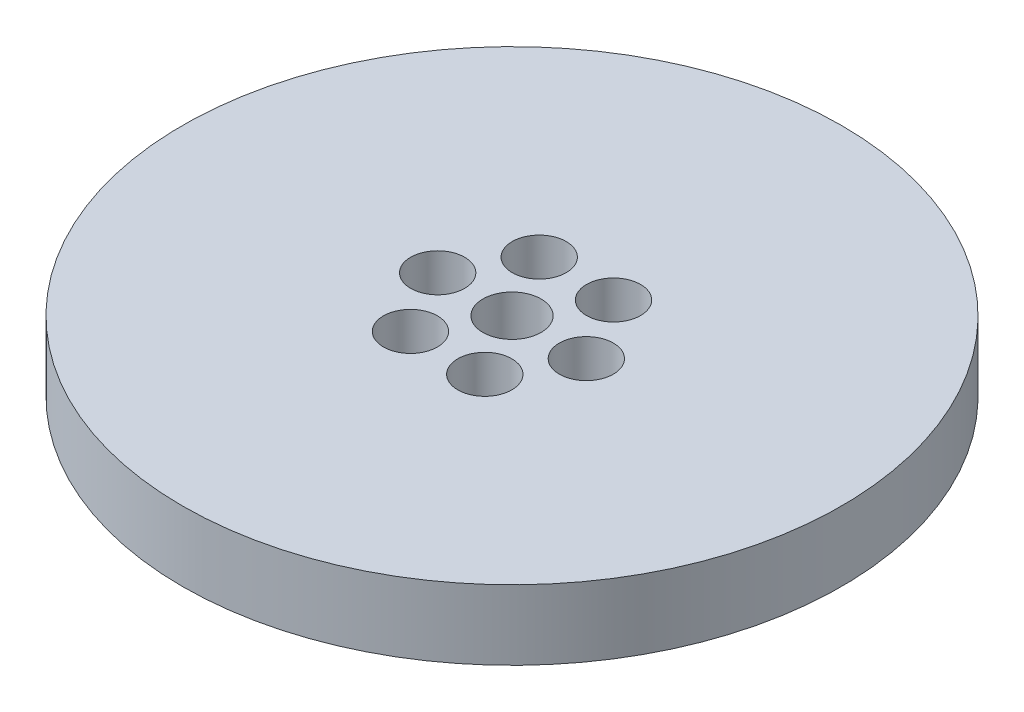
ISO-10303-21;
HEADER;
FILE_DESCRIPTION(('STEP AP214'),'2;1');
FILE_NAME('part.step','',(''),(''),'','','');
FILE_SCHEMA(('AUTOMOTIVE_DESIGN { 1 0 10303 214 1 1 1 1 }'));
ENDSEC;
DATA;
#1=APPLICATION_CONTEXT('core data for automotive mechanical design processes');
#2=APPLICATION_PROTOCOL_DEFINITION('international standard','automotive_design',2000,#1);
#3=PRODUCT_CONTEXT('',#1,'mechanical');
#4=PRODUCT('Part','Part','',(#3));
#5=PRODUCT_RELATED_PRODUCT_CATEGORY('part','',(#4));
#6=PRODUCT_DEFINITION_FORMATION('','',#4);
#7=PRODUCT_DEFINITION_CONTEXT('part definition',#1,'design');
#8=PRODUCT_DEFINITION('design','',#6,#7);
#9=PRODUCT_DEFINITION_SHAPE('','',#8);
#10=(LENGTH_UNIT() NAMED_UNIT(*) SI_UNIT(.MILLI.,.METRE.));
#11=(NAMED_UNIT(*) PLANE_ANGLE_UNIT() SI_UNIT($,.RADIAN.));
#12=(NAMED_UNIT(*) SI_UNIT($,.STERADIAN.) SOLID_ANGLE_UNIT());
#13=UNCERTAINTY_MEASURE_WITH_UNIT(LENGTH_MEASURE(1.E-05),#10,'distance_accuracy_value','');
#14=(GEOMETRIC_REPRESENTATION_CONTEXT(3) GLOBAL_UNCERTAINTY_ASSIGNED_CONTEXT((#13)) GLOBAL_UNIT_ASSIGNED_CONTEXT((#10,
#11,#12)) REPRESENTATION_CONTEXT('',''));
#15=CARTESIAN_POINT('',(0.,0.,0.));
#16=DIRECTION('',(0.,0.,1.));
#17=DIRECTION('',(1.,0.,0.));
#18=AXIS2_PLACEMENT_3D('',#15,#16,#17);
#19=CARTESIAN_POINT('',(0.,18.,0.));
#20=DIRECTION('',(0.,-1.,0.));
#21=DIRECTION('',(0.,0.,-1.));
#22=AXIS2_PLACEMENT_3D('',#19,#20,#21);
#23=CYLINDRICAL_SURFACE('',#22,85.);
#24=CARTESIAN_POINT('',(0.,18.,0.));
#25=DIRECTION('',(0.,1.,0.));
#26=DIRECTION('',(0.,0.,1.));
#27=AXIS2_PLACEMENT_3D('',#24,#25,#26);
#28=CIRCLE('',#27,85.);
#29=CARTESIAN_POINT('',(0.,18.,85.));
#30=VERTEX_POINT('',#29);
#31=EDGE_CURVE('E10',#30,#30,#28,.T.);
#32=ORIENTED_EDGE('',*,*,#31,.F.);
#33=EDGE_LOOP('',(#32));
#34=FACE_BOUND('',#33,.T.);
#35=CARTESIAN_POINT('',(0.,0.,0.));
#36=DIRECTION('',(0.,1.,0.));
#37=DIRECTION('',(0.,0.,1.));
#38=AXIS2_PLACEMENT_3D('',#35,#36,#37);
#39=CIRCLE('',#38,85.);
#40=CARTESIAN_POINT('',(0.,0.,85.));
#41=VERTEX_POINT('',#40);
#42=EDGE_CURVE('E37',#41,#41,#39,.T.);
#43=ORIENTED_EDGE('',*,*,#42,.T.);
#44=EDGE_LOOP('',(#43));
#45=FACE_BOUND('',#44,.T.);
#46=ADVANCED_FACE('F40',(#34,#45),#23,.T.);
#47=CARTESIAN_POINT('',(0.,18.,0.));
#48=DIRECTION('',(0.,1.,0.));
#49=DIRECTION('',(0.,0.,1.));
#50=AXIS2_PLACEMENT_3D('',#47,#48,#49);
#51=PLANE('',#50);
#52=CARTESIAN_POINT('',(-9.58529014640994,18.,-16.6022095388709));
#53=DIRECTION('',(0.,1.,0.));
#54=DIRECTION('',(-0.866025403784433,0.,0.50000000000001));
#55=AXIS2_PLACEMENT_3D('',#52,#53,#54);
#56=CIRCLE('',#55,6.96595925630618);
#57=CARTESIAN_POINT('',(-15.6179878240984,18.,-13.1192299107177));
#58=VERTEX_POINT('',#57);
#59=EDGE_CURVE('E70',#58,#58,#56,.T.);
#60=ORIENTED_EDGE('',*,*,#59,.F.);
#61=EDGE_LOOP('',(#60));
#62=FACE_BOUND('',#61,.T.);
#63=CARTESIAN_POINT('',(9.58529014640959,18.,-16.6022095388711));
#64=DIRECTION('',(0.,1.,0.));
#65=DIRECTION('',(-0.866025403784443,0.,-0.499999999999992));
#66=AXIS2_PLACEMENT_3D('',#63,#64,#65);
#67=CIRCLE('',#66,6.96595925630618);
#68=CARTESIAN_POINT('',(3.55259246872105,18.,-20.0851891670241));
#69=VERTEX_POINT('',#68);
#70=EDGE_CURVE('E71',#69,#69,#67,.T.);
#71=ORIENTED_EDGE('',*,*,#70,.F.);
#72=EDGE_LOOP('',(#71));
#73=FACE_BOUND('',#72,.T.);
#74=CARTESIAN_POINT('',(19.1705802928195,18.,0.));
#75=DIRECTION('',(0.,1.,0.));
#76=DIRECTION('',(0.,0.,-1.));
#77=AXIS2_PLACEMENT_3D('',#74,#75,#76);
#78=CIRCLE('',#77,6.96595925630618);
#79=CARTESIAN_POINT('',(19.1705802928195,18.,-6.96595925630618));
#80=VERTEX_POINT('',#79);
#81=EDGE_CURVE('E78',#80,#80,#78,.T.);
#82=ORIENTED_EDGE('',*,*,#81,.F.);
#83=EDGE_LOOP('',(#82));
#84=FACE_BOUND('',#83,.T.);
#85=CARTESIAN_POINT('',(9.58529014640982,18.,16.602209538871));
#86=DIRECTION('',(0.,1.,0.));
#87=DIRECTION('',(0.866025403784436,0.,-0.500000000000004));
#88=AXIS2_PLACEMENT_3D('',#85,#86,#87);
#89=CIRCLE('',#88,6.96595925630618);
#90=CARTESIAN_POINT('',(15.6179878240983,18.,13.1192299107178));
#91=VERTEX_POINT('',#90);
#92=EDGE_CURVE('E84',#91,#91,#89,.T.);
#93=ORIENTED_EDGE('',*,*,#92,.F.);
#94=EDGE_LOOP('',(#93));
#95=FACE_BOUND('',#94,.T.);
#96=CARTESIAN_POINT('',(-9.5852901464097,18.,16.602209538871));
#97=DIRECTION('',(0.,1.,0.));
#98=DIRECTION('',(0.86602540378444,0.,0.499999999999998));
#99=AXIS2_PLACEMENT_3D('',#96,#97,#98);
#100=CIRCLE('',#99,6.96595925630618);
#101=CARTESIAN_POINT('',(-3.55259246872119,18.,20.0851891670241));
#102=VERTEX_POINT('',#101);
#103=EDGE_CURVE('E61',#102,#102,#100,.T.);
#104=ORIENTED_EDGE('',*,*,#103,.F.);
#105=EDGE_LOOP('',(#104));
#106=FACE_BOUND('',#105,.T.);
#107=CARTESIAN_POINT('',(-19.1705802928195,18.,0.));
#108=DIRECTION('',(0.,1.,0.));
#109=DIRECTION('',(0.,0.,1.));
#110=AXIS2_PLACEMENT_3D('',#107,#108,#109);
#111=CIRCLE('',#110,6.96595925630618);
#112=CARTESIAN_POINT('',(-19.1705802928195,18.,6.96595925630618));
#113=VERTEX_POINT('',#112);
#114=EDGE_CURVE('E54',#113,#113,#111,.T.);
#115=ORIENTED_EDGE('',*,*,#114,.F.);
#116=EDGE_LOOP('',(#115));
#117=FACE_BOUND('',#116,.T.);
#118=CARTESIAN_POINT('',(0.,18.,0.));
#119=DIRECTION('',(0.,1.,0.));
#120=DIRECTION('',(0.,0.,1.));
#121=AXIS2_PLACEMENT_3D('',#118,#119,#120);
#122=CIRCLE('',#121,7.5);
#123=CARTESIAN_POINT('',(0.,18.,7.5));
#124=VERTEX_POINT('',#123);
#125=EDGE_CURVE('E50',#124,#124,#122,.T.);
#126=ORIENTED_EDGE('',*,*,#125,.F.);
#127=EDGE_LOOP('',(#126));
#128=FACE_BOUND('',#127,.T.);
#129=ORIENTED_EDGE('',*,*,#31,.T.);
#130=EDGE_LOOP('',(#129));
#131=FACE_BOUND('',#130,.T.);
#132=ADVANCED_FACE('F99',(#62,#73,#84,#95,#106,#117,#128,#131),#51,.T.);
#133=CARTESIAN_POINT('',(0.,0.,0.));
#134=DIRECTION('',(0.,1.,0.));
#135=DIRECTION('',(0.,0.,1.));
#136=AXIS2_PLACEMENT_3D('',#133,#134,#135);
#137=PLANE('',#136);
#138=CARTESIAN_POINT('',(0.,0.,0.));
#139=DIRECTION('',(0.,1.,0.));
#140=DIRECTION('',(0.,0.,1.));
#141=AXIS2_PLACEMENT_3D('',#138,#139,#140);
#142=CIRCLE('',#141,7.5);
#143=CARTESIAN_POINT('',(0.,0.,7.5));
#144=VERTEX_POINT('',#143);
#145=EDGE_CURVE('E47',#144,#144,#142,.T.);
#146=ORIENTED_EDGE('',*,*,#145,.T.);
#147=EDGE_LOOP('',(#146));
#148=FACE_BOUND('',#147,.T.);
#149=ORIENTED_EDGE('',*,*,#42,.F.);
#150=EDGE_LOOP('',(#149));
#151=FACE_BOUND('',#150,.T.);
#152=ADVANCED_FACE('F103',(#148,#151),#137,.F.);
#153=CARTESIAN_POINT('',(0.,18.,0.));
#154=DIRECTION('',(0.,-1.,0.));
#155=DIRECTION('',(0.,0.,-1.));
#156=AXIS2_PLACEMENT_3D('',#153,#154,#155);
#157=CYLINDRICAL_SURFACE('',#156,7.5);
#158=ORIENTED_EDGE('',*,*,#125,.T.);
#159=EDGE_LOOP('',(#158));
#160=FACE_BOUND('',#159,.T.);
#161=ORIENTED_EDGE('',*,*,#145,.F.);
#162=EDGE_LOOP('',(#161));
#163=FACE_BOUND('',#162,.T.);
#164=ADVANCED_FACE('F115',(#160,#163),#157,.F.);
#165=CARTESIAN_POINT('',(-19.1705802928195,6.90566249601949,0.));
#166=DIRECTION('',(0.,1.,0.));
#167=DIRECTION('',(0.,0.,1.));
#168=AXIS2_PLACEMENT_3D('',#165,#166,#167);
#169=CYLINDRICAL_SURFACE('',#168,6.96595925630618);
#170=CARTESIAN_POINT('',(-19.1705802928195,6.90566249601949,0.));
#171=DIRECTION('',(0.,1.,0.));
#172=DIRECTION('',(0.,0.,1.));
#173=AXIS2_PLACEMENT_3D('',#170,#171,#172);
#174=CIRCLE('',#173,6.96595925630618);
#175=CARTESIAN_POINT('',(-19.1705802928195,6.90566249601949,6.96595925630618));
#176=VERTEX_POINT('',#175);
#177=EDGE_CURVE('E55',#176,#176,#174,.T.);
#178=ORIENTED_EDGE('',*,*,#177,.F.);
#179=EDGE_LOOP('',(#178));
#180=FACE_BOUND('',#179,.T.);
#181=ORIENTED_EDGE('',*,*,#114,.T.);
#182=EDGE_LOOP('',(#181));
#183=FACE_BOUND('',#182,.T.);
#184=ADVANCED_FACE('F113',(#180,#183),#169,.F.);
#185=CARTESIAN_POINT('',(-19.1705802928195,6.90566249601949,0.));
#186=DIRECTION('',(0.,1.,0.));
#187=DIRECTION('',(0.,0.,1.));
#188=AXIS2_PLACEMENT_3D('',#185,#186,#187);
#189=PLANE('',#188);
#190=ORIENTED_EDGE('',*,*,#177,.T.);
#191=EDGE_LOOP('',(#190));
#192=FACE_BOUND('',#191,.T.);
#193=ADVANCED_FACE('F144',(#192),#189,.T.);
#194=CARTESIAN_POINT('',(-9.5852901464097,6.90566249601949,16.602209538871));
#195=DIRECTION('',(0.,1.,0.));
#196=DIRECTION('',(0.,0.,1.));
#197=AXIS2_PLACEMENT_3D('',#194,#195,#196);
#198=CYLINDRICAL_SURFACE('',#197,6.96595925630618);
#199=CARTESIAN_POINT('',(-9.5852901464097,6.90566249601949,16.602209538871));
#200=DIRECTION('',(0.,1.,0.));
#201=DIRECTION('',(0.86602540378444,0.,0.499999999999998));
#202=AXIS2_PLACEMENT_3D('',#199,#200,#201);
#203=CIRCLE('',#202,6.96595925630618);
#204=CARTESIAN_POINT('',(-3.55259246872119,6.90566249601949,20.0851891670241));
#205=VERTEX_POINT('',#204);
#206=EDGE_CURVE('E59',#205,#205,#203,.T.);
#207=ORIENTED_EDGE('',*,*,#206,.F.);
#208=EDGE_LOOP('',(#207));
#209=FACE_BOUND('',#208,.T.);
#210=ORIENTED_EDGE('',*,*,#103,.T.);
#211=EDGE_LOOP('',(#210));
#212=FACE_BOUND('',#211,.T.);
#213=ADVANCED_FACE('F153',(#209,#212),#198,.F.);
#214=CARTESIAN_POINT('',(-9.5852901464097,6.90566249601949,16.602209538871));
#215=DIRECTION('',(0.,1.,0.));
#216=DIRECTION('',(0.86602540378444,0.,0.499999999999998));
#217=AXIS2_PLACEMENT_3D('',#214,#215,#216);
#218=PLANE('',#217);
#219=ORIENTED_EDGE('',*,*,#206,.T.);
#220=EDGE_LOOP('',(#219));
#221=FACE_BOUND('',#220,.T.);
#222=ADVANCED_FACE('F96',(#221),#218,.T.);
#223=CARTESIAN_POINT('',(9.58529014640982,6.90566249601949,16.602209538871));
#224=DIRECTION('',(0.,1.,0.));
#225=DIRECTION('',(0.,0.,1.));
#226=AXIS2_PLACEMENT_3D('',#223,#224,#225);
#227=CYLINDRICAL_SURFACE('',#226,6.96595925630618);
#228=CARTESIAN_POINT('',(9.58529014640982,6.90566249601949,16.602209538871));
#229=DIRECTION('',(0.,1.,0.));
#230=DIRECTION('',(0.866025403784436,0.,-0.500000000000004));
#231=AXIS2_PLACEMENT_3D('',#228,#229,#230);
#232=CIRCLE('',#231,6.96595925630618);
#233=CARTESIAN_POINT('',(15.6179878240983,6.90566249601949,13.1192299107178));
#234=VERTEX_POINT('',#233);
#235=EDGE_CURVE('E63',#234,#234,#232,.T.);
#236=ORIENTED_EDGE('',*,*,#235,.F.);
#237=EDGE_LOOP('',(#236));
#238=FACE_BOUND('',#237,.T.);
#239=ORIENTED_EDGE('',*,*,#92,.T.);
#240=EDGE_LOOP('',(#239));
#241=FACE_BOUND('',#240,.T.);
#242=ADVANCED_FACE('F91',(#238,#241),#227,.F.);
#243=CARTESIAN_POINT('',(9.58529014640982,6.90566249601949,16.602209538871));
#244=DIRECTION('',(0.,1.,0.));
#245=DIRECTION('',(0.866025403784436,0.,-0.500000000000004));
#246=AXIS2_PLACEMENT_3D('',#243,#244,#245);
#247=PLANE('',#246);
#248=ORIENTED_EDGE('',*,*,#235,.T.);
#249=EDGE_LOOP('',(#248));
#250=FACE_BOUND('',#249,.T.);
#251=ADVANCED_FACE('F93',(#250),#247,.T.);
#252=CARTESIAN_POINT('',(19.1705802928195,6.90566249601949,0.));
#253=DIRECTION('',(0.,1.,0.));
#254=DIRECTION('',(0.,0.,1.));
#255=AXIS2_PLACEMENT_3D('',#252,#253,#254);
#256=CYLINDRICAL_SURFACE('',#255,6.96595925630618);
#257=CARTESIAN_POINT('',(19.1705802928195,6.90566249601949,0.));
#258=DIRECTION('',(0.,1.,0.));
#259=DIRECTION('',(0.,0.,-1.));
#260=AXIS2_PLACEMENT_3D('',#257,#258,#259);
#261=CIRCLE('',#260,6.96595925630618);
#262=CARTESIAN_POINT('',(19.1705802928195,6.90566249601949,-6.96595925630618));
#263=VERTEX_POINT('',#262);
#264=EDGE_CURVE('E85',#263,#263,#261,.T.);
#265=ORIENTED_EDGE('',*,*,#264,.F.);
#266=EDGE_LOOP('',(#265));
#267=FACE_BOUND('',#266,.T.);
#268=ORIENTED_EDGE('',*,*,#81,.T.);
#269=EDGE_LOOP('',(#268));
#270=FACE_BOUND('',#269,.T.);
#271=ADVANCED_FACE('F187',(#267,#270),#256,.F.);
#272=CARTESIAN_POINT('',(19.1705802928195,6.90566249601949,0.));
#273=DIRECTION('',(0.,1.,0.));
#274=DIRECTION('',(0.,0.,-1.));
#275=AXIS2_PLACEMENT_3D('',#272,#273,#274);
#276=PLANE('',#275);
#277=ORIENTED_EDGE('',*,*,#264,.T.);
#278=EDGE_LOOP('',(#277));
#279=FACE_BOUND('',#278,.T.);
#280=ADVANCED_FACE('F198',(#279),#276,.T.);
#281=CARTESIAN_POINT('',(9.58529014640959,6.90566249601949,-16.6022095388711));
#282=DIRECTION('',(0.,1.,0.));
#283=DIRECTION('',(0.,0.,1.));
#284=AXIS2_PLACEMENT_3D('',#281,#282,#283);
#285=CYLINDRICAL_SURFACE('',#284,6.96595925630618);
#286=CARTESIAN_POINT('',(9.58529014640959,6.90566249601949,-16.6022095388711));
#287=DIRECTION('',(0.,1.,0.));
#288=DIRECTION('',(-0.866025403784443,0.,-0.499999999999992));
#289=AXIS2_PLACEMENT_3D('',#286,#287,#288);
#290=CIRCLE('',#289,6.96595925630618);
#291=CARTESIAN_POINT('',(3.55259246872105,6.90566249601949,-20.0851891670241));
#292=VERTEX_POINT('',#291);
#293=EDGE_CURVE('E76',#292,#292,#290,.T.);
#294=ORIENTED_EDGE('',*,*,#293,.F.);
#295=EDGE_LOOP('',(#294));
#296=FACE_BOUND('',#295,.T.);
#297=ORIENTED_EDGE('',*,*,#70,.T.);
#298=EDGE_LOOP('',(#297));
#299=FACE_BOUND('',#298,.T.);
#300=ADVANCED_FACE('F202',(#296,#299),#285,.F.);
#301=CARTESIAN_POINT('',(9.58529014640959,6.90566249601949,-16.6022095388711));
#302=DIRECTION('',(0.,1.,0.));
#303=DIRECTION('',(-0.866025403784443,0.,-0.499999999999992));
#304=AXIS2_PLACEMENT_3D('',#301,#302,#303);
#305=PLANE('',#304);
#306=ORIENTED_EDGE('',*,*,#293,.T.);
#307=EDGE_LOOP('',(#306));
#308=FACE_BOUND('',#307,.T.);
#309=ADVANCED_FACE('F212',(#308),#305,.T.);
#310=CARTESIAN_POINT('',(-9.58529014640994,6.90566249601949,-16.6022095388709));
#311=DIRECTION('',(0.,1.,0.));
#312=DIRECTION('',(0.,0.,1.));
#313=AXIS2_PLACEMENT_3D('',#310,#311,#312);
#314=CYLINDRICAL_SURFACE('',#313,6.96595925630618);
#315=CARTESIAN_POINT('',(-9.58529014640994,6.90566249601949,-16.6022095388709));
#316=DIRECTION('',(0.,1.,0.));
#317=DIRECTION('',(-0.866025403784433,0.,0.50000000000001));
#318=AXIS2_PLACEMENT_3D('',#315,#316,#317);
#319=CIRCLE('',#318,6.96595925630618);
#320=CARTESIAN_POINT('',(-15.6179878240984,6.90566249601949,-13.1192299107177));
#321=VERTEX_POINT('',#320);
#322=EDGE_CURVE('E69',#321,#321,#319,.T.);
#323=ORIENTED_EDGE('',*,*,#322,.F.);
#324=EDGE_LOOP('',(#323));
#325=FACE_BOUND('',#324,.T.);
#326=ORIENTED_EDGE('',*,*,#59,.T.);
#327=EDGE_LOOP('',(#326));
#328=FACE_BOUND('',#327,.T.);
#329=ADVANCED_FACE('F224',(#325,#328),#314,.F.);
#330=CARTESIAN_POINT('',(-9.58529014640994,6.90566249601949,-16.6022095388709));
#331=DIRECTION('',(0.,1.,0.));
#332=DIRECTION('',(-0.866025403784433,0.,0.50000000000001));
#333=AXIS2_PLACEMENT_3D('',#330,#331,#332);
#334=PLANE('',#333);
#335=ORIENTED_EDGE('',*,*,#322,.T.);
#336=EDGE_LOOP('',(#335));
#337=FACE_BOUND('',#336,.T.);
#338=ADVANCED_FACE('F235',(#337),#334,.T.);
#339=CLOSED_SHELL('',(#46,#132,#152,#164,#184,#193,#213,#222,#242,#251,#271,#280,#300,#309,#329,#338));
#340=MANIFOLD_SOLID_BREP('B2',#339);
#341=ADVANCED_BREP_SHAPE_REPRESENTATION('',(#18,#340),#14);
#342=SHAPE_DEFINITION_REPRESENTATION(#9,#341);
ENDSEC;
END-ISO-10303-21;
